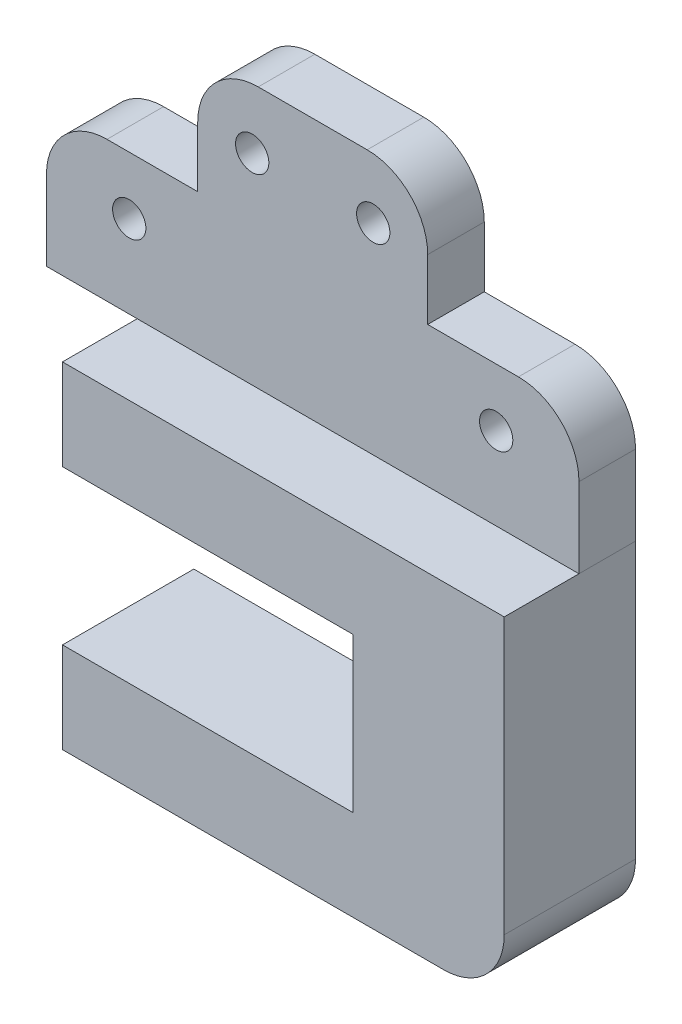
ISO-10303-21;
HEADER;
FILE_DESCRIPTION(('STEP AP214'),'2;1');
FILE_NAME('part.step','',(''),(''),'','','');
FILE_SCHEMA(('AUTOMOTIVE_DESIGN { 1 0 10303 214 1 1 1 1 }'));
ENDSEC;
DATA;
#1=APPLICATION_CONTEXT('core data for automotive mechanical design processes');
#2=APPLICATION_PROTOCOL_DEFINITION('international standard','automotive_design',2000,#1);
#3=PRODUCT_CONTEXT('',#1,'mechanical');
#4=PRODUCT('Part','Part','',(#3));
#5=PRODUCT_RELATED_PRODUCT_CATEGORY('part','',(#4));
#6=PRODUCT_DEFINITION_FORMATION('','',#4);
#7=PRODUCT_DEFINITION_CONTEXT('part definition',#1,'design');
#8=PRODUCT_DEFINITION('design','',#6,#7);
#9=PRODUCT_DEFINITION_SHAPE('','',#8);
#10=(LENGTH_UNIT() NAMED_UNIT(*) SI_UNIT(.MILLI.,.METRE.));
#11=(NAMED_UNIT(*) PLANE_ANGLE_UNIT() SI_UNIT($,.RADIAN.));
#12=(NAMED_UNIT(*) SI_UNIT($,.STERADIAN.) SOLID_ANGLE_UNIT());
#13=UNCERTAINTY_MEASURE_WITH_UNIT(LENGTH_MEASURE(1.E-05),#10,'distance_accuracy_value','');
#14=(GEOMETRIC_REPRESENTATION_CONTEXT(3) GLOBAL_UNCERTAINTY_ASSIGNED_CONTEXT((#13)) GLOBAL_UNIT_ASSIGNED_CONTEXT((#10,
#11,#12)) REPRESENTATION_CONTEXT('',''));
#15=CARTESIAN_POINT('',(0.,0.,0.));
#16=DIRECTION('',(0.,0.,1.));
#17=DIRECTION('',(1.,0.,0.));
#18=AXIS2_PLACEMENT_3D('',#15,#16,#17);
#19=CARTESIAN_POINT('',(44.,0.,21.7));
#20=DIRECTION('',(0.,1.,0.));
#21=DIRECTION('',(-1.,0.,0.));
#22=AXIS2_PLACEMENT_3D('',#19,#20,#21);
#23=PLANE('',#22);
#24=DIRECTION('',(1.,0.,0.));
#25=VECTOR('',#24,1.);
#26=CARTESIAN_POINT('',(44.,0.,0.));
#27=LINE('',#26,#25);
#28=CARTESIAN_POINT('',(-29.,0.,0.));
#29=VERTEX_POINT('',#28);
#30=CARTESIAN_POINT('',(44.,0.,0.));
#31=VERTEX_POINT('',#30);
#32=EDGE_CURVE('E164',#29,#31,#27,.T.);
#33=ORIENTED_EDGE('',*,*,#32,.F.);
#34=DIRECTION('',(0.,0.,-1.));
#35=VECTOR('',#34,1.);
#36=CARTESIAN_POINT('',(-29.,0.,21.7));
#37=LINE('',#36,#35);
#38=CARTESIAN_POINT('',(-29.,0.,21.7));
#39=VERTEX_POINT('',#38);
#40=EDGE_CURVE('E140',#39,#29,#37,.T.);
#41=ORIENTED_EDGE('',*,*,#40,.F.);
#42=DIRECTION('',(1.,0.,0.));
#43=VECTOR('',#42,1.);
#44=CARTESIAN_POINT('',(44.,0.,21.7));
#45=LINE('',#44,#43);
#46=CARTESIAN_POINT('',(44.,0.,21.7));
#47=VERTEX_POINT('',#46);
#48=EDGE_CURVE('E135',#39,#47,#45,.T.);
#49=ORIENTED_EDGE('',*,*,#48,.T.);
#50=DIRECTION('',(0.,0.,-1.));
#51=VECTOR('',#50,1.);
#52=CARTESIAN_POINT('',(44.,0.,21.7));
#53=LINE('',#52,#51);
#54=EDGE_CURVE('E117',#47,#31,#53,.T.);
#55=ORIENTED_EDGE('',*,*,#54,.T.);
#56=EDGE_LOOP('',(#33,#41,#49,#55));
#57=FACE_BOUND('',#56,.T.);
#58=ADVANCED_FACE('F48',(#57),#23,.T.);
#59=CARTESIAN_POINT('',(-29.,-15.,21.7));
#60=DIRECTION('',(-1.,0.,0.));
#61=DIRECTION('',(0.,0.,1.));
#62=AXIS2_PLACEMENT_3D('',#59,#60,#61);
#63=PLANE('',#62);
#64=CARTESIAN_POINT('',(-29.,-7.50000000000001,16.555));
#65=DIRECTION('',(-1.,0.,0.));
#66=DIRECTION('',(0.,0.,1.));
#67=AXIS2_PLACEMENT_3D('',#64,#65,#66);
#68=CIRCLE('',#67,1.75);
#69=CARTESIAN_POINT('',(-29.,-7.50000000000001,18.305));
#70=VERTEX_POINT('',#69);
#71=EDGE_CURVE('E292',#70,#70,#68,.T.);
#72=ORIENTED_EDGE('',*,*,#71,.F.);
#73=EDGE_LOOP('',(#72));
#74=FACE_BOUND('',#73,.T.);
#75=CARTESIAN_POINT('',(-29.,-7.50000000000001,5.145));
#76=DIRECTION('',(-1.,0.,0.));
#77=DIRECTION('',(0.,0.,1.));
#78=AXIS2_PLACEMENT_3D('',#75,#76,#77);
#79=CIRCLE('',#78,1.75);
#80=CARTESIAN_POINT('',(-29.,-7.50000000000001,6.895));
#81=VERTEX_POINT('',#80);
#82=EDGE_CURVE('E147',#81,#81,#79,.T.);
#83=ORIENTED_EDGE('',*,*,#82,.F.);
#84=EDGE_LOOP('',(#83));
#85=FACE_BOUND('',#84,.T.);
#86=DIRECTION('',(0.,1.,0.));
#87=VECTOR('',#86,1.);
#88=CARTESIAN_POINT('',(-29.,-15.,0.));
#89=LINE('',#88,#87);
#90=CARTESIAN_POINT('',(-29.,-15.,0.));
#91=VERTEX_POINT('',#90);
#92=EDGE_CURVE('E141',#91,#29,#89,.T.);
#93=ORIENTED_EDGE('',*,*,#92,.F.);
#94=DIRECTION('',(0.,0.,-1.));
#95=VECTOR('',#94,1.);
#96=CARTESIAN_POINT('',(-29.,-15.,21.7));
#97=LINE('',#96,#95);
#98=CARTESIAN_POINT('',(-29.,-15.,21.7));
#99=VERTEX_POINT('',#98);
#100=EDGE_CURVE('E183',#99,#91,#97,.T.);
#101=ORIENTED_EDGE('',*,*,#100,.F.);
#102=DIRECTION('',(0.,1.,0.));
#103=VECTOR('',#102,1.);
#104=CARTESIAN_POINT('',(-29.,-15.,21.7));
#105=LINE('',#104,#103);
#106=EDGE_CURVE('E129',#99,#39,#105,.T.);
#107=ORIENTED_EDGE('',*,*,#106,.T.);
#108=ORIENTED_EDGE('',*,*,#40,.T.);
#109=EDGE_LOOP('',(#93,#101,#107,#108));
#110=FACE_BOUND('',#109,.T.);
#111=ADVANCED_FACE('F199',(#74,#85,#110),#63,.T.);
#112=CARTESIAN_POINT('',(19.,-15.,21.7));
#113=DIRECTION('',(0.,-1.,0.));
#114=DIRECTION('',(0.,0.,-1.));
#115=AXIS2_PLACEMENT_3D('',#112,#113,#114);
#116=PLANE('',#115);
#117=DIRECTION('',(-1.,0.,0.));
#118=VECTOR('',#117,1.);
#119=CARTESIAN_POINT('',(19.,-15.,0.));
#120=LINE('',#119,#118);
#121=CARTESIAN_POINT('',(19.,-15.,0.));
#122=VERTEX_POINT('',#121);
#123=EDGE_CURVE('E144',#122,#91,#120,.T.);
#124=ORIENTED_EDGE('',*,*,#123,.F.);
#125=DIRECTION('',(0.,0.,-1.));
#126=VECTOR('',#125,1.);
#127=CARTESIAN_POINT('',(19.,-15.,21.7));
#128=LINE('',#127,#126);
#129=CARTESIAN_POINT('',(19.,-15.,21.7));
#130=VERTEX_POINT('',#129);
#131=EDGE_CURVE('E185',#130,#122,#128,.T.);
#132=ORIENTED_EDGE('',*,*,#131,.F.);
#133=DIRECTION('',(-1.,0.,0.));
#134=VECTOR('',#133,1.);
#135=CARTESIAN_POINT('',(19.,-15.,21.7));
#136=LINE('',#135,#134);
#137=EDGE_CURVE('E160',#130,#99,#136,.T.);
#138=ORIENTED_EDGE('',*,*,#137,.T.);
#139=ORIENTED_EDGE('',*,*,#100,.T.);
#140=EDGE_LOOP('',(#124,#132,#138,#139));
#141=FACE_BOUND('',#140,.T.);
#142=ADVANCED_FACE('F228',(#141),#116,.T.);
#143=CARTESIAN_POINT('',(19.,-40.5,21.7));
#144=DIRECTION('',(-1.,0.,0.));
#145=DIRECTION('',(0.,0.,1.));
#146=AXIS2_PLACEMENT_3D('',#143,#144,#145);
#147=PLANE('',#146);
#148=DIRECTION('',(0.,1.,0.));
#149=VECTOR('',#148,1.);
#150=CARTESIAN_POINT('',(19.,-40.5,0.));
#151=LINE('',#150,#149);
#152=CARTESIAN_POINT('',(19.,-40.5,0.));
#153=VERTEX_POINT('',#152);
#154=EDGE_CURVE('E176',#153,#122,#151,.T.);
#155=ORIENTED_EDGE('',*,*,#154,.F.);
#156=DIRECTION('',(0.,0.,-1.));
#157=VECTOR('',#156,1.);
#158=CARTESIAN_POINT('',(19.,-40.5,21.7));
#159=LINE('',#158,#157);
#160=CARTESIAN_POINT('',(19.,-40.5,21.7));
#161=VERTEX_POINT('',#160);
#162=EDGE_CURVE('E187',#161,#153,#159,.T.);
#163=ORIENTED_EDGE('',*,*,#162,.F.);
#164=DIRECTION('',(0.,1.,0.));
#165=VECTOR('',#164,1.);
#166=CARTESIAN_POINT('',(19.,-40.5,21.7));
#167=LINE('',#166,#165);
#168=EDGE_CURVE('E157',#161,#130,#167,.T.);
#169=ORIENTED_EDGE('',*,*,#168,.T.);
#170=ORIENTED_EDGE('',*,*,#131,.T.);
#171=EDGE_LOOP('',(#155,#163,#169,#170));
#172=FACE_BOUND('',#171,.T.);
#173=ADVANCED_FACE('F206',(#172),#147,.T.);
#174=CARTESIAN_POINT('',(-29.,-40.5,21.7));
#175=DIRECTION('',(0.,1.,0.));
#176=DIRECTION('',(0.,0.,1.));
#177=AXIS2_PLACEMENT_3D('',#174,#175,#176);
#178=PLANE('',#177);
#179=DIRECTION('',(1.,0.,0.));
#180=VECTOR('',#179,1.);
#181=CARTESIAN_POINT('',(-29.,-40.5,0.));
#182=LINE('',#181,#180);
#183=CARTESIAN_POINT('',(-29.,-40.5,0.));
#184=VERTEX_POINT('',#183);
#185=EDGE_CURVE('E173',#184,#153,#182,.T.);
#186=ORIENTED_EDGE('',*,*,#185,.F.);
#187=DIRECTION('',(0.,0.,-1.));
#188=VECTOR('',#187,1.);
#189=CARTESIAN_POINT('',(-29.,-40.5,21.7));
#190=LINE('',#189,#188);
#191=CARTESIAN_POINT('',(-29.,-40.5,21.7));
#192=VERTEX_POINT('',#191);
#193=EDGE_CURVE('E189',#192,#184,#190,.T.);
#194=ORIENTED_EDGE('',*,*,#193,.F.);
#195=DIRECTION('',(1.,0.,0.));
#196=VECTOR('',#195,1.);
#197=CARTESIAN_POINT('',(-29.,-40.5,21.7));
#198=LINE('',#197,#196);
#199=EDGE_CURVE('E154',#192,#161,#198,.T.);
#200=ORIENTED_EDGE('',*,*,#199,.T.);
#201=ORIENTED_EDGE('',*,*,#162,.T.);
#202=EDGE_LOOP('',(#186,#194,#200,#201));
#203=FACE_BOUND('',#202,.T.);
#204=ADVANCED_FACE('F209',(#203),#178,.T.);
#205=CARTESIAN_POINT('',(-29.,-55.5,21.7));
#206=DIRECTION('',(-1.,0.,0.));
#207=DIRECTION('',(0.,0.,1.));
#208=AXIS2_PLACEMENT_3D('',#205,#206,#207);
#209=PLANE('',#208);
#210=CARTESIAN_POINT('',(-29.,-48.,5.145));
#211=DIRECTION('',(-1.,0.,0.));
#212=DIRECTION('',(0.,0.,-1.));
#213=AXIS2_PLACEMENT_3D('',#210,#211,#212);
#214=CIRCLE('',#213,1.75);
#215=CARTESIAN_POINT('',(-29.,-48.,3.395));
#216=VERTEX_POINT('',#215);
#217=EDGE_CURVE('E288',#216,#216,#214,.T.);
#218=ORIENTED_EDGE('',*,*,#217,.F.);
#219=EDGE_LOOP('',(#218));
#220=FACE_BOUND('',#219,.T.);
#221=CARTESIAN_POINT('',(-29.,-48.,16.555));
#222=DIRECTION('',(-1.,0.,0.));
#223=DIRECTION('',(0.,0.,-1.));
#224=AXIS2_PLACEMENT_3D('',#221,#222,#223);
#225=CIRCLE('',#224,1.75);
#226=CARTESIAN_POINT('',(-29.,-48.,14.805));
#227=VERTEX_POINT('',#226);
#228=EDGE_CURVE('E283',#227,#227,#225,.T.);
#229=ORIENTED_EDGE('',*,*,#228,.F.);
#230=EDGE_LOOP('',(#229));
#231=FACE_BOUND('',#230,.T.);
#232=DIRECTION('',(0.,1.,0.));
#233=VECTOR('',#232,1.);
#234=CARTESIAN_POINT('',(-29.,-55.5,0.));
#235=LINE('',#234,#233);
#236=CARTESIAN_POINT('',(-29.,-55.5,0.));
#237=VERTEX_POINT('',#236);
#238=EDGE_CURVE('E170',#237,#184,#235,.T.);
#239=ORIENTED_EDGE('',*,*,#238,.F.);
#240=DIRECTION('',(0.,0.,-1.));
#241=VECTOR('',#240,1.);
#242=CARTESIAN_POINT('',(-29.,-55.5,21.7));
#243=LINE('',#242,#241);
#244=CARTESIAN_POINT('',(-29.,-55.5,21.7));
#245=VERTEX_POINT('',#244);
#246=EDGE_CURVE('E128',#245,#237,#243,.T.);
#247=ORIENTED_EDGE('',*,*,#246,.F.);
#248=DIRECTION('',(0.,1.,0.));
#249=VECTOR('',#248,1.);
#250=CARTESIAN_POINT('',(-29.,-55.5,21.7));
#251=LINE('',#250,#249);
#252=EDGE_CURVE('E151',#245,#192,#251,.T.);
#253=ORIENTED_EDGE('',*,*,#252,.T.);
#254=ORIENTED_EDGE('',*,*,#193,.T.);
#255=EDGE_LOOP('',(#239,#247,#253,#254));
#256=FACE_BOUND('',#255,.T.);
#257=ADVANCED_FACE('F214',(#220,#231,#256),#209,.T.);
#258=CARTESIAN_POINT('',(44.,-55.5,21.7));
#259=DIRECTION('',(0.,-1.,0.));
#260=DIRECTION('',(0.,0.,-1.));
#261=AXIS2_PLACEMENT_3D('',#258,#259,#260);
#262=PLANE('',#261);
#263=DIRECTION('',(-1.,0.,0.));
#264=VECTOR('',#263,1.);
#265=CARTESIAN_POINT('',(44.,-55.5,0.));
#266=LINE('',#265,#264);
#267=CARTESIAN_POINT('',(34.,-55.5,0.));
#268=VERTEX_POINT('',#267);
#269=EDGE_CURVE('E168',#268,#237,#266,.T.);
#270=ORIENTED_EDGE('',*,*,#269,.F.);
#271=DIRECTION('',(0.,0.,-1.));
#272=VECTOR('',#271,1.);
#273=CARTESIAN_POINT('',(34.,-55.5,21.7));
#274=LINE('',#273,#272);
#275=CARTESIAN_POINT('',(34.,-55.5,21.7));
#276=VERTEX_POINT('',#275);
#277=EDGE_CURVE('E56',#268,#276,#274,.F.);
#278=ORIENTED_EDGE('',*,*,#277,.T.);
#279=DIRECTION('',(-1.,0.,0.));
#280=VECTOR('',#279,1.);
#281=CARTESIAN_POINT('',(44.,-55.5,21.7));
#282=LINE('',#281,#280);
#283=EDGE_CURVE('E138',#276,#245,#282,.T.);
#284=ORIENTED_EDGE('',*,*,#283,.T.);
#285=ORIENTED_EDGE('',*,*,#246,.T.);
#286=EDGE_LOOP('',(#270,#278,#284,#285));
#287=FACE_BOUND('',#286,.T.);
#288=ADVANCED_FACE('F215',(#287),#262,.T.);
#289=CARTESIAN_POINT('',(44.,0.,21.7));
#290=DIRECTION('',(1.,0.,0.));
#291=DIRECTION('',(0.,1.,0.));
#292=AXIS2_PLACEMENT_3D('',#289,#290,#291);
#293=PLANE('',#292);
#294=DIRECTION('',(0.,-1.,0.));
#295=VECTOR('',#294,1.);
#296=CARTESIAN_POINT('',(44.,0.,21.7));
#297=LINE('',#296,#295);
#298=CARTESIAN_POINT('',(44.,-45.5,21.7));
#299=VERTEX_POINT('',#298);
#300=EDGE_CURVE('E121',#47,#299,#297,.T.);
#301=ORIENTED_EDGE('',*,*,#300,.T.);
#302=DIRECTION('',(0.,0.,-1.));
#303=VECTOR('',#302,1.);
#304=CARTESIAN_POINT('',(44.,-45.5,21.7));
#305=LINE('',#304,#303);
#306=CARTESIAN_POINT('',(44.,-45.5,0.));
#307=VERTEX_POINT('',#306);
#308=EDGE_CURVE('E182',#299,#307,#305,.T.);
#309=ORIENTED_EDGE('',*,*,#308,.T.);
#310=DIRECTION('',(0.,-1.,0.));
#311=VECTOR('',#310,1.);
#312=CARTESIAN_POINT('',(44.,0.,0.));
#313=LINE('',#312,#311);
#314=EDGE_CURVE('E123',#31,#307,#313,.T.);
#315=ORIENTED_EDGE('',*,*,#314,.F.);
#316=ORIENTED_EDGE('',*,*,#54,.F.);
#317=EDGE_LOOP('',(#301,#309,#315,#316));
#318=FACE_BOUND('',#317,.T.);
#319=ADVANCED_FACE('F119',(#318),#293,.T.);
#320=CARTESIAN_POINT('',(0.,0.,21.7));
#321=DIRECTION('',(0.,0.,-1.));
#322=DIRECTION('',(-1.,0.,0.));
#323=AXIS2_PLACEMENT_3D('',#320,#321,#322);
#324=PLANE('',#323);
#325=ORIENTED_EDGE('',*,*,#283,.F.);
#326=CARTESIAN_POINT('',(34.,-45.5,21.7));
#327=DIRECTION('',(0.,0.,-1.));
#328=DIRECTION('',(-1.,0.,0.));
#329=AXIS2_PLACEMENT_3D('',#326,#327,#328);
#330=CIRCLE('',#329,10.);
#331=EDGE_CURVE('E12',#276,#299,#330,.F.);
#332=ORIENTED_EDGE('',*,*,#331,.T.);
#333=ORIENTED_EDGE('',*,*,#300,.F.);
#334=ORIENTED_EDGE('',*,*,#48,.F.);
#335=ORIENTED_EDGE('',*,*,#106,.F.);
#336=ORIENTED_EDGE('',*,*,#137,.F.);
#337=ORIENTED_EDGE('',*,*,#168,.F.);
#338=ORIENTED_EDGE('',*,*,#199,.F.);
#339=ORIENTED_EDGE('',*,*,#252,.F.);
#340=EDGE_LOOP('',(#325,#332,#333,#334,#335,#336,#337,#338,#339));
#341=FACE_BOUND('',#340,.T.);
#342=ADVANCED_FACE('F133',(#341),#324,.F.);
#343=CARTESIAN_POINT('',(0.,0.,0.));
#344=DIRECTION('',(0.,0.,-1.));
#345=DIRECTION('',(-1.,0.,0.));
#346=AXIS2_PLACEMENT_3D('',#343,#344,#345);
#347=PLANE('',#346);
#348=ORIENTED_EDGE('',*,*,#314,.T.);
#349=CARTESIAN_POINT('',(34.,-45.5,0.));
#350=DIRECTION('',(0.,0.,-1.));
#351=DIRECTION('',(-1.,0.,0.));
#352=AXIS2_PLACEMENT_3D('',#349,#350,#351);
#353=CIRCLE('',#352,10.);
#354=EDGE_CURVE('E70',#307,#268,#353,.T.);
#355=ORIENTED_EDGE('',*,*,#354,.T.);
#356=ORIENTED_EDGE('',*,*,#269,.T.);
#357=ORIENTED_EDGE('',*,*,#238,.T.);
#358=ORIENTED_EDGE('',*,*,#185,.T.);
#359=ORIENTED_EDGE('',*,*,#154,.T.);
#360=ORIENTED_EDGE('',*,*,#123,.T.);
#361=ORIENTED_EDGE('',*,*,#92,.T.);
#362=ORIENTED_EDGE('',*,*,#32,.T.);
#363=EDGE_LOOP('',(#348,#355,#356,#357,#358,#359,#360,#361,#362));
#364=FACE_BOUND('',#363,.T.);
#365=ADVANCED_FACE('F195',(#364),#347,.T.);
#366=CARTESIAN_POINT('',(-14.,-48.,16.555));
#367=DIRECTION('',(-1.,0.,0.));
#368=DIRECTION('',(0.,0.,1.));
#369=AXIS2_PLACEMENT_3D('',#366,#367,#368);
#370=CYLINDRICAL_SURFACE('',#369,1.75);
#371=CARTESIAN_POINT('',(-14.,-48.,16.555));
#372=DIRECTION('',(-1.,0.,0.));
#373=DIRECTION('',(0.,0.,-1.));
#374=AXIS2_PLACEMENT_3D('',#371,#372,#373);
#375=CIRCLE('',#374,1.75);
#376=CARTESIAN_POINT('',(-14.,-48.,14.805));
#377=VERTEX_POINT('',#376);
#378=EDGE_CURVE('E280',#377,#377,#375,.T.);
#379=ORIENTED_EDGE('',*,*,#378,.F.);
#380=EDGE_LOOP('',(#379));
#381=FACE_BOUND('',#380,.T.);
#382=ORIENTED_EDGE('',*,*,#228,.T.);
#383=EDGE_LOOP('',(#382));
#384=FACE_BOUND('',#383,.T.);
#385=ADVANCED_FACE('F247',(#381,#384),#370,.F.);
#386=CARTESIAN_POINT('',(-14.,-48.,16.555));
#387=DIRECTION('',(1.,0.,0.));
#388=DIRECTION('',(0.,0.,-1.));
#389=AXIS2_PLACEMENT_3D('',#386,#387,#388);
#390=PLANE('',#389);
#391=ORIENTED_EDGE('',*,*,#378,.T.);
#392=EDGE_LOOP('',(#391));
#393=FACE_BOUND('',#392,.T.);
#394=ADVANCED_FACE('F264',(#393),#390,.F.);
#395=CARTESIAN_POINT('',(-14.,-48.,5.145));
#396=DIRECTION('',(-1.,0.,0.));
#397=DIRECTION('',(0.,0.,1.));
#398=AXIS2_PLACEMENT_3D('',#395,#396,#397);
#399=CYLINDRICAL_SURFACE('',#398,1.75);
#400=CARTESIAN_POINT('',(-14.,-48.,5.145));
#401=DIRECTION('',(-1.,0.,0.));
#402=DIRECTION('',(0.,0.,-1.));
#403=AXIS2_PLACEMENT_3D('',#400,#401,#402);
#404=CIRCLE('',#403,1.75);
#405=CARTESIAN_POINT('',(-14.,-48.,3.395));
#406=VERTEX_POINT('',#405);
#407=EDGE_CURVE('E285',#406,#406,#404,.T.);
#408=ORIENTED_EDGE('',*,*,#407,.F.);
#409=EDGE_LOOP('',(#408));
#410=FACE_BOUND('',#409,.T.);
#411=ORIENTED_EDGE('',*,*,#217,.T.);
#412=EDGE_LOOP('',(#411));
#413=FACE_BOUND('',#412,.T.);
#414=ADVANCED_FACE('F261',(#410,#413),#399,.F.);
#415=CARTESIAN_POINT('',(-14.,-48.,5.145));
#416=DIRECTION('',(1.,0.,0.));
#417=DIRECTION('',(0.,0.,-1.));
#418=AXIS2_PLACEMENT_3D('',#415,#416,#417);
#419=PLANE('',#418);
#420=ORIENTED_EDGE('',*,*,#407,.T.);
#421=EDGE_LOOP('',(#420));
#422=FACE_BOUND('',#421,.T.);
#423=ADVANCED_FACE('F254',(#422),#419,.F.);
#424=CARTESIAN_POINT('',(-14.,-7.50000000000001,5.145));
#425=DIRECTION('',(-1.,0.,0.));
#426=DIRECTION('',(0.,0.,1.));
#427=AXIS2_PLACEMENT_3D('',#424,#425,#426);
#428=CYLINDRICAL_SURFACE('',#427,1.75);
#429=CARTESIAN_POINT('',(-14.,-7.50000000000001,5.145));
#430=DIRECTION('',(-1.,0.,0.));
#431=DIRECTION('',(0.,0.,1.));
#432=AXIS2_PLACEMENT_3D('',#429,#430,#431);
#433=CIRCLE('',#432,1.75);
#434=CARTESIAN_POINT('',(-14.,-7.50000000000001,6.895));
#435=VERTEX_POINT('',#434);
#436=EDGE_CURVE('E166',#435,#435,#433,.T.);
#437=ORIENTED_EDGE('',*,*,#436,.F.);
#438=EDGE_LOOP('',(#437));
#439=FACE_BOUND('',#438,.T.);
#440=ORIENTED_EDGE('',*,*,#82,.T.);
#441=EDGE_LOOP('',(#440));
#442=FACE_BOUND('',#441,.T.);
#443=ADVANCED_FACE('F250',(#439,#442),#428,.F.);
#444=CARTESIAN_POINT('',(-14.,-7.50000000000001,5.145));
#445=DIRECTION('',(-1.,0.,0.));
#446=DIRECTION('',(0.,0.,1.));
#447=AXIS2_PLACEMENT_3D('',#444,#445,#446);
#448=PLANE('',#447);
#449=ORIENTED_EDGE('',*,*,#436,.T.);
#450=EDGE_LOOP('',(#449));
#451=FACE_BOUND('',#450,.T.);
#452=ADVANCED_FACE('F253',(#451),#448,.T.);
#453=CARTESIAN_POINT('',(-14.,-7.50000000000001,16.555));
#454=DIRECTION('',(-1.,0.,0.));
#455=DIRECTION('',(0.,0.,1.));
#456=AXIS2_PLACEMENT_3D('',#453,#454,#455);
#457=CYLINDRICAL_SURFACE('',#456,1.75);
#458=CARTESIAN_POINT('',(-14.,-7.50000000000001,16.555));
#459=DIRECTION('',(-1.,0.,0.));
#460=DIRECTION('',(0.,0.,1.));
#461=AXIS2_PLACEMENT_3D('',#458,#459,#460);
#462=CIRCLE('',#461,1.75);
#463=CARTESIAN_POINT('',(-14.,-7.50000000000001,18.305));
#464=VERTEX_POINT('',#463);
#465=EDGE_CURVE('E295',#464,#464,#462,.T.);
#466=ORIENTED_EDGE('',*,*,#465,.F.);
#467=EDGE_LOOP('',(#466));
#468=FACE_BOUND('',#467,.T.);
#469=ORIENTED_EDGE('',*,*,#71,.T.);
#470=EDGE_LOOP('',(#469));
#471=FACE_BOUND('',#470,.T.);
#472=ADVANCED_FACE('F221',(#468,#471),#457,.F.);
#473=CARTESIAN_POINT('',(-14.,-7.50000000000001,16.555));
#474=DIRECTION('',(-1.,0.,0.));
#475=DIRECTION('',(0.,0.,1.));
#476=AXIS2_PLACEMENT_3D('',#473,#474,#475);
#477=PLANE('',#476);
#478=ORIENTED_EDGE('',*,*,#465,.T.);
#479=EDGE_LOOP('',(#478));
#480=FACE_BOUND('',#479,.T.);
#481=ADVANCED_FACE('F217',(#480),#477,.T.);
#482=CARTESIAN_POINT('',(34.,-45.5,21.7));
#483=DIRECTION('',(0.,0.,-1.));
#484=DIRECTION('',(-1.,0.,0.));
#485=AXIS2_PLACEMENT_3D('',#482,#483,#484);
#486=CYLINDRICAL_SURFACE('',#485,10.);
#487=ORIENTED_EDGE('',*,*,#331,.F.);
#488=ORIENTED_EDGE('',*,*,#277,.F.);
#489=ORIENTED_EDGE('',*,*,#354,.F.);
#490=ORIENTED_EDGE('',*,*,#308,.F.);
#491=EDGE_LOOP('',(#487,#488,#489,#490));
#492=FACE_BOUND('',#491,.T.);
#493=ADVANCED_FACE('F50',(#492),#486,.T.);
#494=CLOSED_SHELL('',(#58,#111,#142,#173,#204,#257,#288,#319,#342,#365,#385,#394,#414,#423,#443,
#452,#472,#481,#493));
#495=MANIFOLD_SOLID_BREP('B2',#494);
#496=CARTESIAN_POINT('',(0.,0.,9.35));
#497=DIRECTION('',(0.,0.,1.));
#498=DIRECTION('',(1.,0.,0.));
#499=AXIS2_PLACEMENT_3D('',#496,#497,#498);
#500=PLANE('',#499);
#501=CARTESIAN_POINT('',(-30.32,13.65,9.35));
#502=DIRECTION('',(0.,0.,1.));
#503=DIRECTION('',(-1.,0.,0.));
#504=AXIS2_PLACEMENT_3D('',#501,#502,#503);
#505=CIRCLE('',#504,2.74999999999999);
#506=CARTESIAN_POINT('',(-33.07,13.65,9.35));
#507=VERTEX_POINT('',#506);
#508=EDGE_CURVE('E666',#507,#507,#505,.T.);
#509=ORIENTED_EDGE('',*,*,#508,.F.);
#510=EDGE_LOOP('',(#509));
#511=FACE_BOUND('',#510,.T.);
#512=CARTESIAN_POINT('',(10.,33.18,9.35));
#513=DIRECTION('',(0.,0.,1.));
#514=DIRECTION('',(1.,0.,0.));
#515=AXIS2_PLACEMENT_3D('',#512,#513,#514);
#516=CIRCLE('',#515,2.75);
#517=CARTESIAN_POINT('',(12.75,33.18,9.35));
#518=VERTEX_POINT('',#517);
#519=EDGE_CURVE('E645',#518,#518,#516,.T.);
#520=ORIENTED_EDGE('',*,*,#519,.F.);
#521=EDGE_LOOP('',(#520));
#522=FACE_BOUND('',#521,.T.);
#523=DIRECTION('',(0.,1.,0.));
#524=VECTOR('',#523,1.);
#525=CARTESIAN_POINT('',(44.,0.,9.35));
#526=LINE('',#525,#524);
#527=CARTESIAN_POINT('',(44.,0.,9.35));
#528=VERTEX_POINT('',#527);
#529=CARTESIAN_POINT('',(44.,13.18,9.35));
#530=VERTEX_POINT('',#529);
#531=EDGE_CURVE('E548',#528,#530,#526,.T.);
#532=ORIENTED_EDGE('',*,*,#531,.T.);
#533=CARTESIAN_POINT('',(34.,13.18,9.35));
#534=DIRECTION('',(0.,0.,1.));
#535=DIRECTION('',(1.,0.,0.));
#536=AXIS2_PLACEMENT_3D('',#533,#534,#535);
#537=CIRCLE('',#536,10.);
#538=CARTESIAN_POINT('',(34.,23.18,9.35));
#539=VERTEX_POINT('',#538);
#540=EDGE_CURVE('E596',#530,#539,#537,.T.);
#541=ORIENTED_EDGE('',*,*,#540,.T.);
#542=DIRECTION('',(-1.,0.,0.));
#543=VECTOR('',#542,1.);
#544=CARTESIAN_POINT('',(44.,23.18,9.35));
#545=LINE('',#544,#543);
#546=CARTESIAN_POINT('',(19.,23.18,9.35));
#547=VERTEX_POINT('',#546);
#548=EDGE_CURVE('E558',#539,#547,#545,.T.);
#549=ORIENTED_EDGE('',*,*,#548,.T.);
#550=DIRECTION('',(0.,1.,0.));
#551=VECTOR('',#550,1.);
#552=CARTESIAN_POINT('',(19.,23.18,9.35));
#553=LINE('',#552,#551);
#554=CARTESIAN_POINT('',(19.,33.18,9.35));
#555=VERTEX_POINT('',#554);
#556=EDGE_CURVE('E653',#547,#555,#553,.T.);
#557=ORIENTED_EDGE('',*,*,#556,.T.);
#558=CARTESIAN_POINT('',(9.00000000000002,33.18,9.35));
#559=DIRECTION('',(0.,0.,1.));
#560=DIRECTION('',(1.,0.,0.));
#561=AXIS2_PLACEMENT_3D('',#558,#559,#560);
#562=CIRCLE('',#561,10.);
#563=CARTESIAN_POINT('',(9.00000000000002,43.18,9.35));
#564=VERTEX_POINT('',#563);
#565=EDGE_CURVE('E594',#555,#564,#562,.T.);
#566=ORIENTED_EDGE('',*,*,#565,.T.);
#567=DIRECTION('',(-1.,0.,0.));
#568=VECTOR('',#567,1.);
#569=CARTESIAN_POINT('',(-19.,43.18,9.35));
#570=LINE('',#569,#568);
#571=CARTESIAN_POINT('',(-9.00000000000001,43.18,9.35));
#572=VERTEX_POINT('',#571);
#573=EDGE_CURVE('E650',#564,#572,#570,.T.);
#574=ORIENTED_EDGE('',*,*,#573,.T.);
#575=CARTESIAN_POINT('',(-9.00000000000001,33.18,9.35));
#576=DIRECTION('',(0.,0.,1.));
#577=DIRECTION('',(1.,0.,0.));
#578=AXIS2_PLACEMENT_3D('',#575,#576,#577);
#579=CIRCLE('',#578,10.);
#580=CARTESIAN_POINT('',(-19.,33.18,9.35));
#581=VERTEX_POINT('',#580);
#582=EDGE_CURVE('E592',#572,#581,#579,.T.);
#583=ORIENTED_EDGE('',*,*,#582,.T.);
#584=DIRECTION('',(0.,-1.,0.));
#585=VECTOR('',#584,1.);
#586=CARTESIAN_POINT('',(-19.,23.18,9.35));
#587=LINE('',#586,#585);
#588=CARTESIAN_POINT('',(-19.,23.18,9.35));
#589=VERTEX_POINT('',#588);
#590=EDGE_CURVE('E648',#581,#589,#587,.T.);
#591=ORIENTED_EDGE('',*,*,#590,.T.);
#592=DIRECTION('',(-1.,0.,0.));
#593=VECTOR('',#592,1.);
#594=CARTESIAN_POINT('',(-44.,23.18,9.35));
#595=LINE('',#594,#593);
#596=CARTESIAN_POINT('',(-34.,23.18,9.35));
#597=VERTEX_POINT('',#596);
#598=EDGE_CURVE('E628',#589,#597,#595,.T.);
#599=ORIENTED_EDGE('',*,*,#598,.T.);
#600=CARTESIAN_POINT('',(-34.,13.18,9.35));
#601=DIRECTION('',(0.,0.,1.));
#602=DIRECTION('',(1.,0.,0.));
#603=AXIS2_PLACEMENT_3D('',#600,#601,#602);
#604=CIRCLE('',#603,10.);
#605=CARTESIAN_POINT('',(-44.,13.18,9.35));
#606=VERTEX_POINT('',#605);
#607=EDGE_CURVE('E474',#597,#606,#604,.T.);
#608=ORIENTED_EDGE('',*,*,#607,.T.);
#609=DIRECTION('',(0.,-1.,0.));
#610=VECTOR('',#609,1.);
#611=CARTESIAN_POINT('',(-44.,0.,9.35));
#612=LINE('',#611,#610);
#613=CARTESIAN_POINT('',(-44.,0.,9.35));
#614=VERTEX_POINT('',#613);
#615=EDGE_CURVE('E563',#606,#614,#612,.T.);
#616=ORIENTED_EDGE('',*,*,#615,.T.);
#617=DIRECTION('',(1.,0.,0.));
#618=VECTOR('',#617,1.);
#619=CARTESIAN_POINT('',(-44.,0.,9.35));
#620=LINE('',#619,#618);
#621=EDGE_CURVE('E559',#614,#528,#620,.T.);
#622=ORIENTED_EDGE('',*,*,#621,.T.);
#623=EDGE_LOOP('',(#532,#541,#549,#557,#566,#574,#583,#591,#599,#608,#616,#622));
#624=FACE_BOUND('',#623,.T.);
#625=CARTESIAN_POINT('',(30.32,13.65,9.35));
#626=DIRECTION('',(0.,0.,1.));
#627=DIRECTION('',(1.,0.,0.));
#628=AXIS2_PLACEMENT_3D('',#625,#626,#627);
#629=CIRCLE('',#628,2.75000000000001);
#630=CARTESIAN_POINT('',(33.07,13.65,9.35));
#631=VERTEX_POINT('',#630);
#632=EDGE_CURVE('E660',#631,#631,#629,.T.);
#633=ORIENTED_EDGE('',*,*,#632,.F.);
#634=EDGE_LOOP('',(#633));
#635=FACE_BOUND('',#634,.T.);
#636=CARTESIAN_POINT('',(-10.,33.18,9.35));
#637=DIRECTION('',(0.,0.,1.));
#638=DIRECTION('',(-1.,0.,0.));
#639=AXIS2_PLACEMENT_3D('',#636,#637,#638);
#640=CIRCLE('',#639,2.75);
#641=CARTESIAN_POINT('',(-12.75,33.18,9.35));
#642=VERTEX_POINT('',#641);
#643=EDGE_CURVE('E672',#642,#642,#640,.T.);
#644=ORIENTED_EDGE('',*,*,#643,.F.);
#645=EDGE_LOOP('',(#644));
#646=FACE_BOUND('',#645,.T.);
#647=ADVANCED_FACE('F459',(#511,#522,#624,#635,#646),#500,.T.);
#648=CARTESIAN_POINT('',(0.,0.,0.));
#649=DIRECTION('',(0.,0.,1.));
#650=DIRECTION('',(1.,0.,0.));
#651=AXIS2_PLACEMENT_3D('',#648,#649,#650);
#652=PLANE('',#651);
#653=DIRECTION('',(-1.,0.,0.));
#654=VECTOR('',#653,1.);
#655=CARTESIAN_POINT('',(44.,23.18,0.));
#656=LINE('',#655,#654);
#657=CARTESIAN_POINT('',(34.,23.18,0.));
#658=VERTEX_POINT('',#657);
#659=CARTESIAN_POINT('',(19.,23.18,0.));
#660=VERTEX_POINT('',#659);
#661=EDGE_CURVE('E640',#658,#660,#656,.T.);
#662=ORIENTED_EDGE('',*,*,#661,.F.);
#663=CARTESIAN_POINT('',(34.,13.18,0.));
#664=DIRECTION('',(0.,0.,1.));
#665=DIRECTION('',(1.,0.,0.));
#666=AXIS2_PLACEMENT_3D('',#663,#664,#665);
#667=CIRCLE('',#666,10.);
#668=CARTESIAN_POINT('',(44.,13.18,0.));
#669=VERTEX_POINT('',#668);
#670=EDGE_CURVE('E588',#658,#669,#667,.F.);
#671=ORIENTED_EDGE('',*,*,#670,.T.);
#672=DIRECTION('',(0.,1.,0.));
#673=VECTOR('',#672,1.);
#674=CARTESIAN_POINT('',(44.,0.,0.));
#675=LINE('',#674,#673);
#676=CARTESIAN_POINT('',(44.,0.,0.));
#677=VERTEX_POINT('',#676);
#678=EDGE_CURVE('E642',#677,#669,#675,.T.);
#679=ORIENTED_EDGE('',*,*,#678,.F.);
#680=DIRECTION('',(1.,0.,0.));
#681=VECTOR('',#680,1.);
#682=CARTESIAN_POINT('',(-44.,0.,0.));
#683=LINE('',#682,#681);
#684=CARTESIAN_POINT('',(-44.,0.,0.));
#685=VERTEX_POINT('',#684);
#686=EDGE_CURVE('E571',#685,#677,#683,.T.);
#687=ORIENTED_EDGE('',*,*,#686,.F.);
#688=DIRECTION('',(0.,-1.,0.));
#689=VECTOR('',#688,1.);
#690=CARTESIAN_POINT('',(-44.,0.,0.));
#691=LINE('',#690,#689);
#692=CARTESIAN_POINT('',(-44.,13.18,0.));
#693=VERTEX_POINT('',#692);
#694=EDGE_CURVE('E567',#693,#685,#691,.T.);
#695=ORIENTED_EDGE('',*,*,#694,.F.);
#696=CARTESIAN_POINT('',(-34.,13.18,0.));
#697=DIRECTION('',(0.,0.,1.));
#698=DIRECTION('',(1.,0.,0.));
#699=AXIS2_PLACEMENT_3D('',#696,#697,#698);
#700=CIRCLE('',#699,10.);
#701=CARTESIAN_POINT('',(-34.,23.18,0.));
#702=VERTEX_POINT('',#701);
#703=EDGE_CURVE('E576',#693,#702,#700,.F.);
#704=ORIENTED_EDGE('',*,*,#703,.T.);
#705=DIRECTION('',(-1.,0.,0.));
#706=VECTOR('',#705,1.);
#707=CARTESIAN_POINT('',(-44.,23.18,0.));
#708=LINE('',#707,#706);
#709=CARTESIAN_POINT('',(-19.,23.18,0.));
#710=VERTEX_POINT('',#709);
#711=EDGE_CURVE('E618',#710,#702,#708,.T.);
#712=ORIENTED_EDGE('',*,*,#711,.F.);
#713=DIRECTION('',(0.,-1.,0.));
#714=VECTOR('',#713,1.);
#715=CARTESIAN_POINT('',(-19.,23.18,0.));
#716=LINE('',#715,#714);
#717=CARTESIAN_POINT('',(-19.,33.18,0.));
#718=VERTEX_POINT('',#717);
#719=EDGE_CURVE('E620',#718,#710,#716,.T.);
#720=ORIENTED_EDGE('',*,*,#719,.F.);
#721=CARTESIAN_POINT('',(-9.00000000000001,33.18,0.));
#722=DIRECTION('',(0.,0.,1.));
#723=DIRECTION('',(1.,0.,0.));
#724=AXIS2_PLACEMENT_3D('',#721,#722,#723);
#725=CIRCLE('',#724,10.);
#726=CARTESIAN_POINT('',(-9.00000000000001,43.18,0.));
#727=VERTEX_POINT('',#726);
#728=EDGE_CURVE('E584',#718,#727,#725,.F.);
#729=ORIENTED_EDGE('',*,*,#728,.T.);
#730=DIRECTION('',(-1.,0.,0.));
#731=VECTOR('',#730,1.);
#732=CARTESIAN_POINT('',(-19.,43.18,0.));
#733=LINE('',#732,#731);
#734=CARTESIAN_POINT('',(9.00000000000002,43.18,0.));
#735=VERTEX_POINT('',#734);
#736=EDGE_CURVE('E634',#735,#727,#733,.T.);
#737=ORIENTED_EDGE('',*,*,#736,.F.);
#738=CARTESIAN_POINT('',(9.00000000000002,33.18,0.));
#739=DIRECTION('',(0.,0.,1.));
#740=DIRECTION('',(1.,0.,0.));
#741=AXIS2_PLACEMENT_3D('',#738,#739,#740);
#742=CIRCLE('',#741,10.);
#743=CARTESIAN_POINT('',(19.,33.18,0.));
#744=VERTEX_POINT('',#743);
#745=EDGE_CURVE('E586',#735,#744,#742,.F.);
#746=ORIENTED_EDGE('',*,*,#745,.T.);
#747=DIRECTION('',(0.,1.,0.));
#748=VECTOR('',#747,1.);
#749=CARTESIAN_POINT('',(19.,23.18,0.));
#750=LINE('',#749,#748);
#751=EDGE_CURVE('E635',#660,#744,#750,.T.);
#752=ORIENTED_EDGE('',*,*,#751,.F.);
#753=EDGE_LOOP('',(#662,#671,#679,#687,#695,#704,#712,#720,#729,#737,#746,#752));
#754=FACE_BOUND('',#753,.T.);
#755=CARTESIAN_POINT('',(10.,33.18,0.));
#756=DIRECTION('',(0.,0.,1.));
#757=DIRECTION('',(1.,0.,0.));
#758=AXIS2_PLACEMENT_3D('',#755,#756,#757);
#759=CIRCLE('',#758,2.75);
#760=CARTESIAN_POINT('',(12.75,33.18,0.));
#761=VERTEX_POINT('',#760);
#762=EDGE_CURVE('E657',#761,#761,#759,.T.);
#763=ORIENTED_EDGE('',*,*,#762,.T.);
#764=EDGE_LOOP('',(#763));
#765=FACE_BOUND('',#764,.T.);
#766=CARTESIAN_POINT('',(30.32,13.65,0.));
#767=DIRECTION('',(0.,0.,1.));
#768=DIRECTION('',(1.,0.,0.));
#769=AXIS2_PLACEMENT_3D('',#766,#767,#768);
#770=CIRCLE('',#769,2.75000000000001);
#771=CARTESIAN_POINT('',(33.07,13.65,0.));
#772=VERTEX_POINT('',#771);
#773=EDGE_CURVE('E663',#772,#772,#770,.T.);
#774=ORIENTED_EDGE('',*,*,#773,.T.);
#775=EDGE_LOOP('',(#774));
#776=FACE_BOUND('',#775,.T.);
#777=CARTESIAN_POINT('',(-30.32,13.65,0.));
#778=DIRECTION('',(0.,0.,1.));
#779=DIRECTION('',(-1.,0.,0.));
#780=AXIS2_PLACEMENT_3D('',#777,#778,#779);
#781=CIRCLE('',#780,2.74999999999999);
#782=CARTESIAN_POINT('',(-33.07,13.65,0.));
#783=VERTEX_POINT('',#782);
#784=EDGE_CURVE('E669',#783,#783,#781,.T.);
#785=ORIENTED_EDGE('',*,*,#784,.T.);
#786=EDGE_LOOP('',(#785));
#787=FACE_BOUND('',#786,.T.);
#788=CARTESIAN_POINT('',(-10.,33.18,0.));
#789=DIRECTION('',(0.,0.,1.));
#790=DIRECTION('',(-1.,0.,0.));
#791=AXIS2_PLACEMENT_3D('',#788,#789,#790);
#792=CIRCLE('',#791,2.75);
#793=CARTESIAN_POINT('',(-12.75,33.18,0.));
#794=VERTEX_POINT('',#793);
#795=EDGE_CURVE('E675',#794,#794,#792,.T.);
#796=ORIENTED_EDGE('',*,*,#795,.T.);
#797=EDGE_LOOP('',(#796));
#798=FACE_BOUND('',#797,.T.);
#799=ADVANCED_FACE('F615',(#754,#765,#776,#787,#798),#652,.F.);
#800=CARTESIAN_POINT('',(-44.,0.,9.35));
#801=DIRECTION('',(0.,1.,0.));
#802=DIRECTION('',(-1.,0.,0.));
#803=AXIS2_PLACEMENT_3D('',#800,#801,#802);
#804=PLANE('',#803);
#805=ORIENTED_EDGE('',*,*,#686,.T.);
#806=DIRECTION('',(0.,0.,-1.));
#807=VECTOR('',#806,1.);
#808=CARTESIAN_POINT('',(44.,0.,9.35));
#809=LINE('',#808,#807);
#810=EDGE_CURVE('E553',#528,#677,#809,.T.);
#811=ORIENTED_EDGE('',*,*,#810,.F.);
#812=ORIENTED_EDGE('',*,*,#621,.F.);
#813=DIRECTION('',(0.,0.,-1.));
#814=VECTOR('',#813,1.);
#815=CARTESIAN_POINT('',(-44.,0.,9.35));
#816=LINE('',#815,#814);
#817=EDGE_CURVE('E624',#614,#685,#816,.T.);
#818=ORIENTED_EDGE('',*,*,#817,.T.);
#819=EDGE_LOOP('',(#805,#811,#812,#818));
#820=FACE_BOUND('',#819,.T.);
#821=ADVANCED_FACE('F569',(#820),#804,.F.);
#822=CARTESIAN_POINT('',(44.,0.,9.35));
#823=DIRECTION('',(-1.,0.,0.));
#824=DIRECTION('',(0.,0.,1.));
#825=AXIS2_PLACEMENT_3D('',#822,#823,#824);
#826=PLANE('',#825);
#827=ORIENTED_EDGE('',*,*,#678,.T.);
#828=DIRECTION('',(0.,0.,-1.));
#829=VECTOR('',#828,1.);
#830=CARTESIAN_POINT('',(44.,13.18,9.35));
#831=LINE('',#830,#829);
#832=EDGE_CURVE('E556',#669,#530,#831,.F.);
#833=ORIENTED_EDGE('',*,*,#832,.T.);
#834=ORIENTED_EDGE('',*,*,#531,.F.);
#835=ORIENTED_EDGE('',*,*,#810,.T.);
#836=EDGE_LOOP('',(#827,#833,#834,#835));
#837=FACE_BOUND('',#836,.T.);
#838=ADVANCED_FACE('F551',(#837),#826,.F.);
#839=CARTESIAN_POINT('',(44.,23.18,9.35));
#840=DIRECTION('',(0.,-1.,0.));
#841=DIRECTION('',(1.,0.,0.));
#842=AXIS2_PLACEMENT_3D('',#839,#840,#841);
#843=PLANE('',#842);
#844=ORIENTED_EDGE('',*,*,#548,.F.);
#845=DIRECTION('',(0.,0.,-1.));
#846=VECTOR('',#845,1.);
#847=CARTESIAN_POINT('',(34.,23.18,9.35));
#848=LINE('',#847,#846);
#849=EDGE_CURVE('E572',#539,#658,#848,.T.);
#850=ORIENTED_EDGE('',*,*,#849,.T.);
#851=ORIENTED_EDGE('',*,*,#661,.T.);
#852=DIRECTION('',(0.,0.,-1.));
#853=VECTOR('',#852,1.);
#854=CARTESIAN_POINT('',(19.,23.18,9.35));
#855=LINE('',#854,#853);
#856=EDGE_CURVE('E573',#547,#660,#855,.T.);
#857=ORIENTED_EDGE('',*,*,#856,.F.);
#858=EDGE_LOOP('',(#844,#850,#851,#857));
#859=FACE_BOUND('',#858,.T.);
#860=ADVANCED_FACE('F711',(#859),#843,.F.);
#861=CARTESIAN_POINT('',(19.,23.18,9.35));
#862=DIRECTION('',(-1.,0.,0.));
#863=DIRECTION('',(0.,-1.,0.));
#864=AXIS2_PLACEMENT_3D('',#861,#862,#863);
#865=PLANE('',#864);
#866=ORIENTED_EDGE('',*,*,#751,.T.);
#867=DIRECTION('',(0.,0.,-1.));
#868=VECTOR('',#867,1.);
#869=CARTESIAN_POINT('',(19.,33.18,9.35));
#870=LINE('',#869,#868);
#871=EDGE_CURVE('E603',#744,#555,#870,.F.);
#872=ORIENTED_EDGE('',*,*,#871,.T.);
#873=ORIENTED_EDGE('',*,*,#556,.F.);
#874=ORIENTED_EDGE('',*,*,#856,.T.);
#875=EDGE_LOOP('',(#866,#872,#873,#874));
#876=FACE_BOUND('',#875,.T.);
#877=ADVANCED_FACE('F707',(#876),#865,.F.);
#878=CARTESIAN_POINT('',(-19.,43.18,9.35));
#879=DIRECTION('',(0.,-1.,0.));
#880=DIRECTION('',(1.,0.,0.));
#881=AXIS2_PLACEMENT_3D('',#878,#879,#880);
#882=PLANE('',#881);
#883=ORIENTED_EDGE('',*,*,#573,.F.);
#884=DIRECTION('',(0.,0.,-1.));
#885=VECTOR('',#884,1.);
#886=CARTESIAN_POINT('',(9.00000000000002,43.18,9.35));
#887=LINE('',#886,#885);
#888=EDGE_CURVE('E600',#564,#735,#887,.T.);
#889=ORIENTED_EDGE('',*,*,#888,.T.);
#890=ORIENTED_EDGE('',*,*,#736,.T.);
#891=DIRECTION('',(0.,0.,-1.));
#892=VECTOR('',#891,1.);
#893=CARTESIAN_POINT('',(-9.00000000000001,43.18,9.35));
#894=LINE('',#893,#892);
#895=EDGE_CURVE('E598',#727,#572,#894,.F.);
#896=ORIENTED_EDGE('',*,*,#895,.T.);
#897=EDGE_LOOP('',(#883,#889,#890,#896));
#898=FACE_BOUND('',#897,.T.);
#899=ADVANCED_FACE('F704',(#898),#882,.F.);
#900=CARTESIAN_POINT('',(-19.,23.18,9.35));
#901=DIRECTION('',(1.,0.,0.));
#902=DIRECTION('',(0.,1.,0.));
#903=AXIS2_PLACEMENT_3D('',#900,#901,#902);
#904=PLANE('',#903);
#905=ORIENTED_EDGE('',*,*,#590,.F.);
#906=DIRECTION('',(0.,0.,-1.));
#907=VECTOR('',#906,1.);
#908=CARTESIAN_POINT('',(-19.,33.18,9.35));
#909=LINE('',#908,#907);
#910=EDGE_CURVE('E605',#581,#718,#909,.T.);
#911=ORIENTED_EDGE('',*,*,#910,.T.);
#912=ORIENTED_EDGE('',*,*,#719,.T.);
#913=DIRECTION('',(0.,0.,-1.));
#914=VECTOR('',#913,1.);
#915=CARTESIAN_POINT('',(-19.,23.18,9.35));
#916=LINE('',#915,#914);
#917=EDGE_CURVE('E579',#589,#710,#916,.T.);
#918=ORIENTED_EDGE('',*,*,#917,.F.);
#919=EDGE_LOOP('',(#905,#911,#912,#918));
#920=FACE_BOUND('',#919,.T.);
#921=ADVANCED_FACE('F701',(#920),#904,.F.);
#922=CARTESIAN_POINT('',(-44.,23.18,9.35));
#923=DIRECTION('',(0.,-1.,0.));
#924=DIRECTION('',(1.,0.,0.));
#925=AXIS2_PLACEMENT_3D('',#922,#923,#924);
#926=PLANE('',#925);
#927=ORIENTED_EDGE('',*,*,#711,.T.);
#928=DIRECTION('',(0.,0.,-1.));
#929=VECTOR('',#928,1.);
#930=CARTESIAN_POINT('',(-34.,23.18,9.35));
#931=LINE('',#930,#929);
#932=EDGE_CURVE('E46',#702,#597,#931,.F.);
#933=ORIENTED_EDGE('',*,*,#932,.T.);
#934=ORIENTED_EDGE('',*,*,#598,.F.);
#935=ORIENTED_EDGE('',*,*,#917,.T.);
#936=EDGE_LOOP('',(#927,#933,#934,#935));
#937=FACE_BOUND('',#936,.T.);
#938=ADVANCED_FACE('F627',(#937),#926,.F.);
#939=CARTESIAN_POINT('',(-44.,0.,9.35));
#940=DIRECTION('',(1.,0.,0.));
#941=DIRECTION('',(0.,0.,-1.));
#942=AXIS2_PLACEMENT_3D('',#939,#940,#941);
#943=PLANE('',#942);
#944=ORIENTED_EDGE('',*,*,#615,.F.);
#945=DIRECTION('',(0.,0.,-1.));
#946=VECTOR('',#945,1.);
#947=CARTESIAN_POINT('',(-44.,13.18,9.35));
#948=LINE('',#947,#946);
#949=EDGE_CURVE('E467',#606,#693,#948,.T.);
#950=ORIENTED_EDGE('',*,*,#949,.T.);
#951=ORIENTED_EDGE('',*,*,#694,.T.);
#952=ORIENTED_EDGE('',*,*,#817,.F.);
#953=EDGE_LOOP('',(#944,#950,#951,#952));
#954=FACE_BOUND('',#953,.T.);
#955=ADVANCED_FACE('F611',(#954),#943,.F.);
#956=CARTESIAN_POINT('',(10.,33.18,9.35));
#957=DIRECTION('',(0.,0.,-1.));
#958=DIRECTION('',(-1.,0.,0.));
#959=AXIS2_PLACEMENT_3D('',#956,#957,#958);
#960=CYLINDRICAL_SURFACE('',#959,2.75);
#961=ORIENTED_EDGE('',*,*,#519,.T.);
#962=EDGE_LOOP('',(#961));
#963=FACE_BOUND('',#962,.T.);
#964=ORIENTED_EDGE('',*,*,#762,.F.);
#965=EDGE_LOOP('',(#964));
#966=FACE_BOUND('',#965,.T.);
#967=ADVANCED_FACE('F694',(#963,#966),#960,.F.);
#968=CARTESIAN_POINT('',(30.32,13.65,9.35));
#969=DIRECTION('',(0.,0.,-1.));
#970=DIRECTION('',(-1.,0.,0.));
#971=AXIS2_PLACEMENT_3D('',#968,#969,#970);
#972=CYLINDRICAL_SURFACE('',#971,2.75000000000001);
#973=ORIENTED_EDGE('',*,*,#632,.T.);
#974=EDGE_LOOP('',(#973));
#975=FACE_BOUND('',#974,.T.);
#976=ORIENTED_EDGE('',*,*,#773,.F.);
#977=EDGE_LOOP('',(#976));
#978=FACE_BOUND('',#977,.T.);
#979=ADVANCED_FACE('F850',(#975,#978),#972,.F.);
#980=CARTESIAN_POINT('',(-30.32,13.65,9.35));
#981=DIRECTION('',(0.,0.,-1.));
#982=DIRECTION('',(-1.,0.,0.));
#983=AXIS2_PLACEMENT_3D('',#980,#981,#982);
#984=CYLINDRICAL_SURFACE('',#983,2.74999999999999);
#985=ORIENTED_EDGE('',*,*,#508,.T.);
#986=EDGE_LOOP('',(#985));
#987=FACE_BOUND('',#986,.T.);
#988=ORIENTED_EDGE('',*,*,#784,.F.);
#989=EDGE_LOOP('',(#988));
#990=FACE_BOUND('',#989,.T.);
#991=ADVANCED_FACE('F840',(#987,#990),#984,.F.);
#992=CARTESIAN_POINT('',(-10.,33.18,9.35));
#993=DIRECTION('',(0.,0.,-1.));
#994=DIRECTION('',(-1.,0.,0.));
#995=AXIS2_PLACEMENT_3D('',#992,#993,#994);
#996=CYLINDRICAL_SURFACE('',#995,2.75);
#997=ORIENTED_EDGE('',*,*,#643,.T.);
#998=EDGE_LOOP('',(#997));
#999=FACE_BOUND('',#998,.T.);
#1000=ORIENTED_EDGE('',*,*,#795,.F.);
#1001=EDGE_LOOP('',(#1000));
#1002=FACE_BOUND('',#1001,.T.);
#1003=ADVANCED_FACE('F681',(#999,#1002),#996,.F.);
#1004=CARTESIAN_POINT('',(34.,13.18,9.35));
#1005=DIRECTION('',(0.,0.,-1.));
#1006=DIRECTION('',(-1.,0.,0.));
#1007=AXIS2_PLACEMENT_3D('',#1004,#1005,#1006);
#1008=CYLINDRICAL_SURFACE('',#1007,10.);
#1009=ORIENTED_EDGE('',*,*,#540,.F.);
#1010=ORIENTED_EDGE('',*,*,#832,.F.);
#1011=ORIENTED_EDGE('',*,*,#670,.F.);
#1012=ORIENTED_EDGE('',*,*,#849,.F.);
#1013=EDGE_LOOP('',(#1009,#1010,#1011,#1012));
#1014=FACE_BOUND('',#1013,.T.);
#1015=ADVANCED_FACE('F720',(#1014),#1008,.T.);
#1016=CARTESIAN_POINT('',(9.00000000000002,33.18,9.35));
#1017=DIRECTION('',(0.,0.,-1.));
#1018=DIRECTION('',(-1.,0.,0.));
#1019=AXIS2_PLACEMENT_3D('',#1016,#1017,#1018);
#1020=CYLINDRICAL_SURFACE('',#1019,10.);
#1021=ORIENTED_EDGE('',*,*,#565,.F.);
#1022=ORIENTED_EDGE('',*,*,#871,.F.);
#1023=ORIENTED_EDGE('',*,*,#745,.F.);
#1024=ORIENTED_EDGE('',*,*,#888,.F.);
#1025=EDGE_LOOP('',(#1021,#1022,#1023,#1024));
#1026=FACE_BOUND('',#1025,.T.);
#1027=ADVANCED_FACE('F723',(#1026),#1020,.T.);
#1028=CARTESIAN_POINT('',(-9.00000000000001,33.18,9.35));
#1029=DIRECTION('',(0.,0.,-1.));
#1030=DIRECTION('',(-1.,0.,0.));
#1031=AXIS2_PLACEMENT_3D('',#1028,#1029,#1030);
#1032=CYLINDRICAL_SURFACE('',#1031,10.);
#1033=ORIENTED_EDGE('',*,*,#582,.F.);
#1034=ORIENTED_EDGE('',*,*,#895,.F.);
#1035=ORIENTED_EDGE('',*,*,#728,.F.);
#1036=ORIENTED_EDGE('',*,*,#910,.F.);
#1037=EDGE_LOOP('',(#1033,#1034,#1035,#1036));
#1038=FACE_BOUND('',#1037,.T.);
#1039=ADVANCED_FACE('F726',(#1038),#1032,.T.);
#1040=CARTESIAN_POINT('',(-34.,13.18,9.35));
#1041=DIRECTION('',(0.,0.,-1.));
#1042=DIRECTION('',(-1.,0.,0.));
#1043=AXIS2_PLACEMENT_3D('',#1040,#1041,#1042);
#1044=CYLINDRICAL_SURFACE('',#1043,10.);
#1045=ORIENTED_EDGE('',*,*,#607,.F.);
#1046=ORIENTED_EDGE('',*,*,#932,.F.);
#1047=ORIENTED_EDGE('',*,*,#703,.F.);
#1048=ORIENTED_EDGE('',*,*,#949,.F.);
#1049=EDGE_LOOP('',(#1045,#1046,#1047,#1048));
#1050=FACE_BOUND('',#1049,.T.);
#1051=ADVANCED_FACE('F461',(#1050),#1044,.T.);
#1052=CLOSED_SHELL('',(#647,#799,#821,#838,#860,#877,#899,#921,#938,#955,#967,#979,#991,#1003,
#1015,#1027,#1039,#1051));
#1053=MANIFOLD_SOLID_BREP('B6',#1052);
#1054=ADVANCED_BREP_SHAPE_REPRESENTATION('',(#18,#495,#1053),#14);
#1055=SHAPE_DEFINITION_REPRESENTATION(#9,#1054);
ENDSEC;
END-ISO-10303-21;
